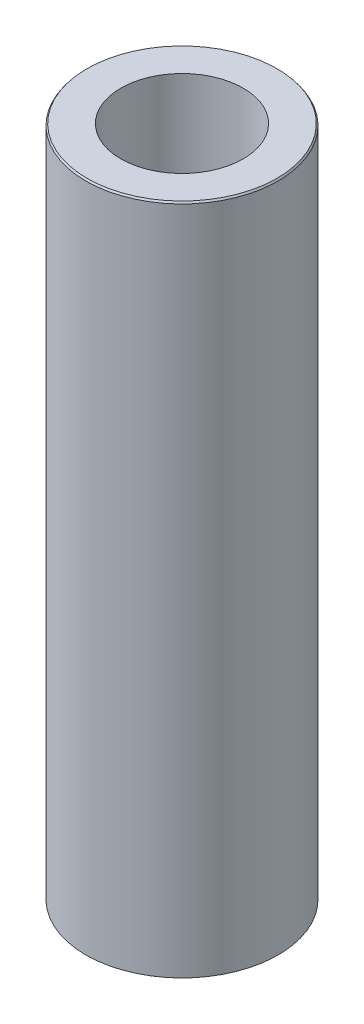
ISO-10303-21;
HEADER;
FILE_DESCRIPTION(('STEP AP214'),'2;1');
FILE_NAME('part.step','',(''),(''),'','','');
FILE_SCHEMA(('AUTOMOTIVE_DESIGN { 1 0 10303 214 1 1 1 1 }'));
ENDSEC;
DATA;
#1=APPLICATION_CONTEXT('core data for automotive mechanical design processes');
#2=APPLICATION_PROTOCOL_DEFINITION('international standard','automotive_design',2000,#1);
#3=PRODUCT_CONTEXT('',#1,'mechanical');
#4=PRODUCT('Part','Part','',(#3));
#5=PRODUCT_RELATED_PRODUCT_CATEGORY('part','',(#4));
#6=PRODUCT_DEFINITION_FORMATION('','',#4);
#7=PRODUCT_DEFINITION_CONTEXT('part definition',#1,'design');
#8=PRODUCT_DEFINITION('design','',#6,#7);
#9=PRODUCT_DEFINITION_SHAPE('','',#8);
#10=(LENGTH_UNIT() NAMED_UNIT(*) SI_UNIT(.MILLI.,.METRE.));
#11=(NAMED_UNIT(*) PLANE_ANGLE_UNIT() SI_UNIT($,.RADIAN.));
#12=(NAMED_UNIT(*) SI_UNIT($,.STERADIAN.) SOLID_ANGLE_UNIT());
#13=UNCERTAINTY_MEASURE_WITH_UNIT(LENGTH_MEASURE(1.E-05),#10,'distance_accuracy_value','');
#14=(GEOMETRIC_REPRESENTATION_CONTEXT(3) GLOBAL_UNCERTAINTY_ASSIGNED_CONTEXT((#13)) GLOBAL_UNIT_ASSIGNED_CONTEXT((#10,
#11,#12)) REPRESENTATION_CONTEXT('',''));
#15=CARTESIAN_POINT('',(0.,0.,0.));
#16=DIRECTION('',(0.,0.,1.));
#17=DIRECTION('',(1.,0.,0.));
#18=AXIS2_PLACEMENT_3D('',#15,#16,#17);
#19=CARTESIAN_POINT('',(0.,349.903128118466,0.));
#20=DIRECTION('',(0.,-1.,0.));
#21=DIRECTION('',(0.,0.,-1.));
#22=AXIS2_PLACEMENT_3D('',#19,#20,#21);
#23=CYLINDRICAL_SURFACE('',#22,50.);
#24=CARTESIAN_POINT('',(0.,349.025429217062,0.));
#25=DIRECTION('',(0.,1.,0.));
#26=DIRECTION('',(0.,0.,1.));
#27=AXIS2_PLACEMENT_3D('',#24,#25,#26);
#28=CIRCLE('',#27,50.);
#29=CARTESIAN_POINT('',(0.,349.025429217062,50.));
#30=VERTEX_POINT('',#29);
#31=EDGE_CURVE('E50',#30,#30,#28,.F.);
#32=ORIENTED_EDGE('',*,*,#31,.T.);
#33=EDGE_LOOP('',(#32));
#34=FACE_BOUND('',#33,.T.);
#35=CARTESIAN_POINT('',(0.,0.62407261030023,0.));
#36=DIRECTION('',(0.,1.,0.));
#37=DIRECTION('',(0.,0.,1.));
#38=AXIS2_PLACEMENT_3D('',#35,#36,#37);
#39=CIRCLE('',#38,50.);
#40=CARTESIAN_POINT('',(0.,0.62407261030023,50.));
#41=VERTEX_POINT('',#40);
#42=EDGE_CURVE('E51',#41,#41,#39,.T.);
#43=ORIENTED_EDGE('',*,*,#42,.T.);
#44=EDGE_LOOP('',(#43));
#45=FACE_BOUND('',#44,.T.);
#46=ADVANCED_FACE('F39',(#34,#45),#23,.T.);
#47=CARTESIAN_POINT('',(0.,349.903128118466,0.));
#48=DIRECTION('',(0.,1.,0.));
#49=DIRECTION('',(0.,0.,1.));
#50=AXIS2_PLACEMENT_3D('',#47,#48,#49);
#51=PLANE('',#50);
#52=CARTESIAN_POINT('',(0.,349.903128118466,0.));
#53=DIRECTION('',(0.,1.,0.));
#54=DIRECTION('',(0.,0.,1.));
#55=AXIS2_PLACEMENT_3D('',#52,#53,#54);
#56=CIRCLE('',#55,49.3759273896997);
#57=CARTESIAN_POINT('',(0.,349.903128118466,49.3759273896997));
#58=VERTEX_POINT('',#57);
#59=EDGE_CURVE('E54',#58,#58,#56,.T.);
#60=ORIENTED_EDGE('',*,*,#59,.T.);
#61=EDGE_LOOP('',(#60));
#62=FACE_BOUND('',#61,.T.);
#63=CARTESIAN_POINT('',(0.,349.903128118466,0.));
#64=DIRECTION('',(0.,1.,0.));
#65=DIRECTION('',(0.,0.,1.));
#66=AXIS2_PLACEMENT_3D('',#63,#64,#65);
#67=CIRCLE('',#66,31.8438457609677);
#68=CARTESIAN_POINT('',(0.,349.903128118466,31.8438457609677));
#69=VERTEX_POINT('',#68);
#70=EDGE_CURVE('E58',#69,#69,#67,.T.);
#71=ORIENTED_EDGE('',*,*,#70,.F.);
#72=EDGE_LOOP('',(#71));
#73=FACE_BOUND('',#72,.T.);
#74=ADVANCED_FACE('F69',(#62,#73),#51,.T.);
#75=CARTESIAN_POINT('',(0.,0.,0.));
#76=DIRECTION('',(0.,1.,0.));
#77=DIRECTION('',(0.,0.,1.));
#78=AXIS2_PLACEMENT_3D('',#75,#76,#77);
#79=PLANE('',#78);
#80=CARTESIAN_POINT('',(0.,0.,0.));
#81=DIRECTION('',(0.,1.,0.));
#82=DIRECTION('',(0.,0.,1.));
#83=AXIS2_PLACEMENT_3D('',#80,#81,#82);
#84=CIRCLE('',#83,49.1223010985953);
#85=CARTESIAN_POINT('',(0.,0.,49.1223010985953));
#86=VERTEX_POINT('',#85);
#87=EDGE_CURVE('E10',#86,#86,#84,.F.);
#88=ORIENTED_EDGE('',*,*,#87,.T.);
#89=EDGE_LOOP('',(#88));
#90=FACE_BOUND('',#89,.T.);
#91=CARTESIAN_POINT('',(0.,0.,0.));
#92=DIRECTION('',(0.,1.,0.));
#93=DIRECTION('',(0.,0.,1.));
#94=AXIS2_PLACEMENT_3D('',#91,#92,#93);
#95=CIRCLE('',#94,31.8438457609677);
#96=CARTESIAN_POINT('',(0.,0.,31.8438457609677));
#97=VERTEX_POINT('',#96);
#98=EDGE_CURVE('E63',#97,#97,#95,.T.);
#99=ORIENTED_EDGE('',*,*,#98,.T.);
#100=EDGE_LOOP('',(#99));
#101=FACE_BOUND('',#100,.T.);
#102=ADVANCED_FACE('F75',(#90,#101),#79,.F.);
#103=CARTESIAN_POINT('',(0.,349.903128118466,0.));
#104=DIRECTION('',(0.,-1.,0.));
#105=DIRECTION('',(0.,0.,-1.));
#106=AXIS2_PLACEMENT_3D('',#103,#104,#105);
#107=CYLINDRICAL_SURFACE('',#106,31.8438457609677);
#108=ORIENTED_EDGE('',*,*,#70,.T.);
#109=EDGE_LOOP('',(#108));
#110=FACE_BOUND('',#109,.T.);
#111=ORIENTED_EDGE('',*,*,#98,.F.);
#112=EDGE_LOOP('',(#111));
#113=FACE_BOUND('',#112,.T.);
#114=ADVANCED_FACE('F70',(#110,#113),#107,.F.);
#115=CARTESIAN_POINT('',(0.,349.903128118466,0.));
#116=DIRECTION('',(0.,-1.,0.));
#117=DIRECTION('',(0.,0.,-1.));
#118=AXIS2_PLACEMENT_3D('',#115,#116,#117);
#119=CONICAL_SURFACE('',#118,49.3759273896997,0.61809214001856);
#120=ORIENTED_EDGE('',*,*,#31,.F.);
#121=EDGE_LOOP('',(#120));
#122=FACE_BOUND('',#121,.T.);
#123=ORIENTED_EDGE('',*,*,#59,.F.);
#124=EDGE_LOOP('',(#123));
#125=FACE_BOUND('',#124,.T.);
#126=ADVANCED_FACE('F81',(#122,#125),#119,.T.);
#127=CARTESIAN_POINT('',(0.,0.62407261030023,0.));
#128=DIRECTION('',(0.,1.,0.));
#129=DIRECTION('',(0.,0.,1.));
#130=AXIS2_PLACEMENT_3D('',#127,#128,#129);
#131=CONICAL_SURFACE('',#130,50.,0.952704186776316);
#132=ORIENTED_EDGE('',*,*,#87,.F.);
#133=EDGE_LOOP('',(#132));
#134=FACE_BOUND('',#133,.T.);
#135=ORIENTED_EDGE('',*,*,#42,.F.);
#136=EDGE_LOOP('',(#135));
#137=FACE_BOUND('',#136,.T.);
#138=ADVANCED_FACE('F45',(#134,#137),#131,.T.);
#139=CLOSED_SHELL('',(#46,#74,#102,#114,#126,#138));
#140=MANIFOLD_SOLID_BREP('B2',#139);
#141=ADVANCED_BREP_SHAPE_REPRESENTATION('',(#18,#140),#14);
#142=SHAPE_DEFINITION_REPRESENTATION(#9,#141);
ENDSEC;
END-ISO-10303-21;
